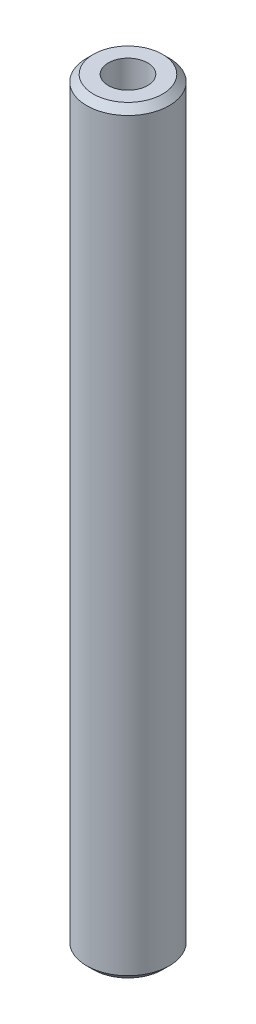
ISO-10303-21;
HEADER;
FILE_DESCRIPTION(('STEP AP214'),'2;1');
FILE_NAME('part.step','',(''),(''),'','','');
FILE_SCHEMA(('AUTOMOTIVE_DESIGN { 1 0 10303 214 1 1 1 1 }'));
ENDSEC;
DATA;
#1=APPLICATION_CONTEXT('core data for automotive mechanical design processes');
#2=APPLICATION_PROTOCOL_DEFINITION('international standard','automotive_design',2000,#1);
#3=PRODUCT_CONTEXT('',#1,'mechanical');
#4=PRODUCT('Part','Part','',(#3));
#5=PRODUCT_RELATED_PRODUCT_CATEGORY('part','',(#4));
#6=PRODUCT_DEFINITION_FORMATION('','',#4);
#7=PRODUCT_DEFINITION_CONTEXT('part definition',#1,'design');
#8=PRODUCT_DEFINITION('design','',#6,#7);
#9=PRODUCT_DEFINITION_SHAPE('','',#8);
#10=(LENGTH_UNIT() NAMED_UNIT(*) SI_UNIT(.MILLI.,.METRE.));
#11=(NAMED_UNIT(*) PLANE_ANGLE_UNIT() SI_UNIT($,.RADIAN.));
#12=(NAMED_UNIT(*) SI_UNIT($,.STERADIAN.) SOLID_ANGLE_UNIT());
#13=UNCERTAINTY_MEASURE_WITH_UNIT(LENGTH_MEASURE(1.E-05),#10,'distance_accuracy_value','');
#14=(GEOMETRIC_REPRESENTATION_CONTEXT(3) GLOBAL_UNCERTAINTY_ASSIGNED_CONTEXT((#13)) GLOBAL_UNIT_ASSIGNED_CONTEXT((#10,
#11,#12)) REPRESENTATION_CONTEXT('',''));
#15=CARTESIAN_POINT('',(0.,0.,0.));
#16=DIRECTION('',(0.,0.,1.));
#17=DIRECTION('',(1.,0.,0.));
#18=AXIS2_PLACEMENT_3D('',#15,#16,#17);
#19=CARTESIAN_POINT('',(0.,92.0166817473124,0.));
#20=DIRECTION('',(0.,-1.,0.));
#21=DIRECTION('',(0.,0.,-1.));
#22=AXIS2_PLACEMENT_3D('',#19,#20,#21);
#23=CYLINDRICAL_SURFACE('',#22,5.);
#24=CARTESIAN_POINT('',(0.,91.2062806837476,0.));
#25=DIRECTION('',(0.,1.,0.));
#26=DIRECTION('',(0.,0.,1.));
#27=AXIS2_PLACEMENT_3D('',#24,#25,#26);
#28=CIRCLE('',#27,5.);
#29=CARTESIAN_POINT('',(0.,91.2062806837476,5.));
#30=VERTEX_POINT('',#29);
#31=EDGE_CURVE('E50',#30,#30,#28,.F.);
#32=ORIENTED_EDGE('',*,*,#31,.T.);
#33=EDGE_LOOP('',(#32));
#34=FACE_BOUND('',#33,.T.);
#35=CARTESIAN_POINT('',(0.,0.810401063564795,0.));
#36=DIRECTION('',(0.,1.,0.));
#37=DIRECTION('',(0.,0.,1.));
#38=AXIS2_PLACEMENT_3D('',#35,#36,#37);
#39=CIRCLE('',#38,5.);
#40=CARTESIAN_POINT('',(0.,0.810401063564795,5.));
#41=VERTEX_POINT('',#40);
#42=EDGE_CURVE('E51',#41,#41,#39,.T.);
#43=ORIENTED_EDGE('',*,*,#42,.T.);
#44=EDGE_LOOP('',(#43));
#45=FACE_BOUND('',#44,.T.);
#46=ADVANCED_FACE('F39',(#34,#45),#23,.T.);
#47=CARTESIAN_POINT('',(0.,92.0166817473124,0.));
#48=DIRECTION('',(0.,1.,0.));
#49=DIRECTION('',(0.,0.,1.));
#50=AXIS2_PLACEMENT_3D('',#47,#48,#49);
#51=PLANE('',#50);
#52=CARTESIAN_POINT('',(0.,92.0166817473124,0.));
#53=DIRECTION('',(0.,1.,0.));
#54=DIRECTION('',(0.,0.,1.));
#55=AXIS2_PLACEMENT_3D('',#52,#53,#54);
#56=CIRCLE('',#55,4.18959893643521);
#57=CARTESIAN_POINT('',(0.,92.0166817473124,4.18959893643521));
#58=VERTEX_POINT('',#57);
#59=EDGE_CURVE('E54',#58,#58,#56,.T.);
#60=ORIENTED_EDGE('',*,*,#59,.T.);
#61=EDGE_LOOP('',(#60));
#62=FACE_BOUND('',#61,.T.);
#63=CARTESIAN_POINT('',(0.,92.0166817473124,0.));
#64=DIRECTION('',(0.,1.,0.));
#65=DIRECTION('',(0.,0.,1.));
#66=AXIS2_PLACEMENT_3D('',#63,#64,#65);
#67=CIRCLE('',#66,2.38860640006963);
#68=CARTESIAN_POINT('',(0.,92.0166817473124,2.38860640006963));
#69=VERTEX_POINT('',#68);
#70=EDGE_CURVE('E58',#69,#69,#67,.T.);
#71=ORIENTED_EDGE('',*,*,#70,.F.);
#72=EDGE_LOOP('',(#71));
#73=FACE_BOUND('',#72,.T.);
#74=ADVANCED_FACE('F69',(#62,#73),#51,.T.);
#75=CARTESIAN_POINT('',(0.,0.,0.));
#76=DIRECTION('',(0.,1.,0.));
#77=DIRECTION('',(0.,0.,1.));
#78=AXIS2_PLACEMENT_3D('',#75,#76,#77);
#79=PLANE('',#78);
#80=CARTESIAN_POINT('',(0.,0.,0.));
#81=DIRECTION('',(0.,1.,0.));
#82=DIRECTION('',(0.,0.,1.));
#83=AXIS2_PLACEMENT_3D('',#80,#81,#82);
#84=CIRCLE('',#83,4.18959893643521);
#85=CARTESIAN_POINT('',(0.,0.,4.18959893643521));
#86=VERTEX_POINT('',#85);
#87=EDGE_CURVE('E10',#86,#86,#84,.F.);
#88=ORIENTED_EDGE('',*,*,#87,.T.);
#89=EDGE_LOOP('',(#88));
#90=FACE_BOUND('',#89,.T.);
#91=CARTESIAN_POINT('',(0.,0.,0.));
#92=DIRECTION('',(0.,1.,0.));
#93=DIRECTION('',(0.,0.,1.));
#94=AXIS2_PLACEMENT_3D('',#91,#92,#93);
#95=CIRCLE('',#94,2.38860640006963);
#96=CARTESIAN_POINT('',(0.,0.,2.38860640006963));
#97=VERTEX_POINT('',#96);
#98=EDGE_CURVE('E63',#97,#97,#95,.T.);
#99=ORIENTED_EDGE('',*,*,#98,.T.);
#100=EDGE_LOOP('',(#99));
#101=FACE_BOUND('',#100,.T.);
#102=ADVANCED_FACE('F75',(#90,#101),#79,.F.);
#103=CARTESIAN_POINT('',(0.,92.0166817473124,0.));
#104=DIRECTION('',(0.,-1.,0.));
#105=DIRECTION('',(0.,0.,-1.));
#106=AXIS2_PLACEMENT_3D('',#103,#104,#105);
#107=CYLINDRICAL_SURFACE('',#106,2.38860640006963);
#108=ORIENTED_EDGE('',*,*,#70,.T.);
#109=EDGE_LOOP('',(#108));
#110=FACE_BOUND('',#109,.T.);
#111=ORIENTED_EDGE('',*,*,#98,.F.);
#112=EDGE_LOOP('',(#111));
#113=FACE_BOUND('',#112,.T.);
#114=ADVANCED_FACE('F70',(#110,#113),#107,.F.);
#115=CARTESIAN_POINT('',(0.,92.0166817473124,0.));
#116=DIRECTION('',(0.,-1.,0.));
#117=DIRECTION('',(0.,0.,-1.));
#118=AXIS2_PLACEMENT_3D('',#115,#116,#117);
#119=CONICAL_SURFACE('',#118,4.18959893643521,0.785398163397446);
#120=ORIENTED_EDGE('',*,*,#31,.F.);
#121=EDGE_LOOP('',(#120));
#122=FACE_BOUND('',#121,.T.);
#123=ORIENTED_EDGE('',*,*,#59,.F.);
#124=EDGE_LOOP('',(#123));
#125=FACE_BOUND('',#124,.T.);
#126=ADVANCED_FACE('F81',(#122,#125),#119,.T.);
#127=CARTESIAN_POINT('',(0.,0.810401063564795,0.));
#128=DIRECTION('',(0.,1.,0.));
#129=DIRECTION('',(0.,0.,1.));
#130=AXIS2_PLACEMENT_3D('',#127,#128,#129);
#131=CONICAL_SURFACE('',#130,5.,0.785398163397446);
#132=ORIENTED_EDGE('',*,*,#87,.F.);
#133=EDGE_LOOP('',(#132));
#134=FACE_BOUND('',#133,.T.);
#135=ORIENTED_EDGE('',*,*,#42,.F.);
#136=EDGE_LOOP('',(#135));
#137=FACE_BOUND('',#136,.T.);
#138=ADVANCED_FACE('F45',(#134,#137),#131,.T.);
#139=CLOSED_SHELL('',(#46,#74,#102,#114,#126,#138));
#140=MANIFOLD_SOLID_BREP('B2',#139);
#141=ADVANCED_BREP_SHAPE_REPRESENTATION('',(#18,#140),#14);
#142=SHAPE_DEFINITION_REPRESENTATION(#9,#141);
ENDSEC;
END-ISO-10303-21;
